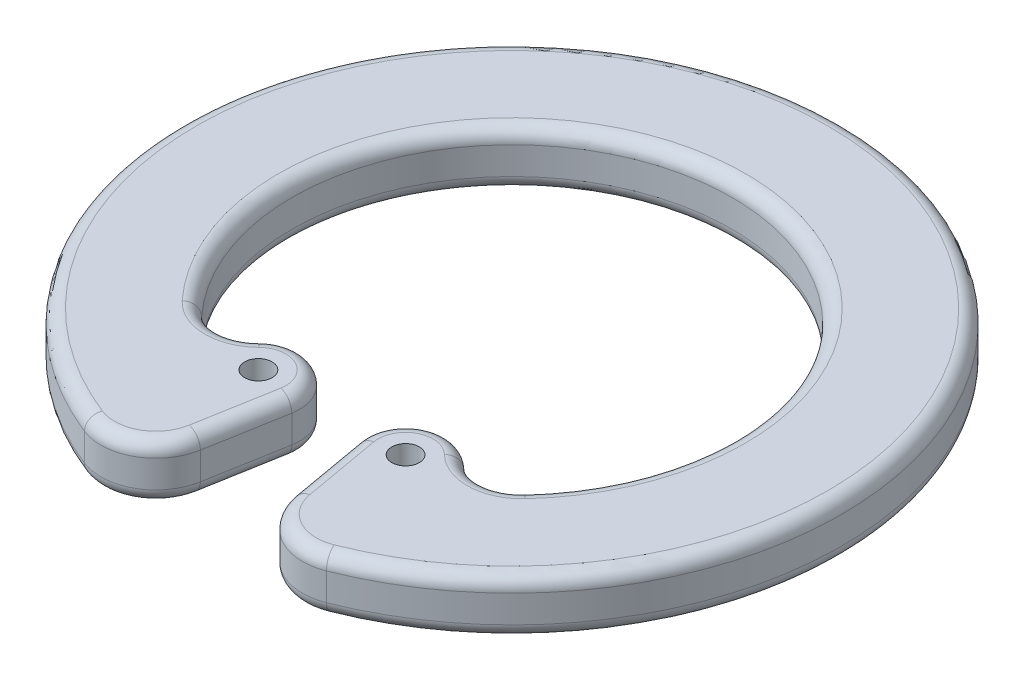
ISO-10303-21;
HEADER;
FILE_DESCRIPTION(('STEP AP214'),'2;1');
FILE_NAME('part.step','',(''),(''),'','','');
FILE_SCHEMA(('AUTOMOTIVE_DESIGN { 1 0 10303 214 1 1 1 1 }'));
ENDSEC;
DATA;
#1=APPLICATION_CONTEXT('core data for automotive mechanical design processes');
#2=APPLICATION_PROTOCOL_DEFINITION('international standard','automotive_design',2000,#1);
#3=PRODUCT_CONTEXT('',#1,'mechanical');
#4=PRODUCT('Part','Part','',(#3));
#5=PRODUCT_RELATED_PRODUCT_CATEGORY('part','',(#4));
#6=PRODUCT_DEFINITION_FORMATION('','',#4);
#7=PRODUCT_DEFINITION_CONTEXT('part definition',#1,'design');
#8=PRODUCT_DEFINITION('design','',#6,#7);
#9=PRODUCT_DEFINITION_SHAPE('','',#8);
#10=(LENGTH_UNIT() NAMED_UNIT(*) SI_UNIT(.MILLI.,.METRE.));
#11=(NAMED_UNIT(*) PLANE_ANGLE_UNIT() SI_UNIT($,.RADIAN.));
#12=(NAMED_UNIT(*) SI_UNIT($,.STERADIAN.) SOLID_ANGLE_UNIT());
#13=UNCERTAINTY_MEASURE_WITH_UNIT(LENGTH_MEASURE(1.E-05),#10,'distance_accuracy_value','');
#14=(GEOMETRIC_REPRESENTATION_CONTEXT(3) GLOBAL_UNCERTAINTY_ASSIGNED_CONTEXT((#13)) GLOBAL_UNIT_ASSIGNED_CONTEXT((#10,
#11,#12)) REPRESENTATION_CONTEXT('',''));
#15=CARTESIAN_POINT('',(0.,0.,0.));
#16=DIRECTION('',(0.,0.,1.));
#17=DIRECTION('',(1.,0.,0.));
#18=AXIS2_PLACEMENT_3D('',#15,#16,#17);
#19=CARTESIAN_POINT('',(3.6710132262169,1.,9.30180960313318));
#20=DIRECTION('',(0.,1.,0.));
#21=DIRECTION('',(0.,0.,1.));
#22=AXIS2_PLACEMENT_3D('',#19,#20,#21);
#23=PLANE('',#22);
#24=DIRECTION('',(0.173648177666924,0.,0.984807753012209));
#25=VECTOR('',#24,1.);
#26=CARTESIAN_POINT('',(2.19380159669859,1.,9.56228186963356));
#27=LINE('',#26,#25);
#28=CARTESIAN_POINT('',(1.6945471049669,1.,6.73086894731305));
#29=VERTEX_POINT('',#28);
#30=CARTESIAN_POINT('',(2.19380159669859,1.,9.56228186963356));
#31=VERTEX_POINT('',#30);
#32=EDGE_CURVE('E60',#29,#31,#27,.T.);
#33=ORIENTED_EDGE('',*,*,#32,.T.);
#34=CARTESIAN_POINT('',(3.6710132262169,1.,9.30180960313318));
#35=DIRECTION('',(0.,1.,0.));
#36=DIRECTION('',(0.,0.,1.));
#37=AXIS2_PLACEMENT_3D('',#34,#35,#36);
#38=CIRCLE('',#37,1.5);
#39=CARTESIAN_POINT('',(4.22166521014944,1.,10.6970810436032));
#40=VERTEX_POINT('',#39);
#41=EDGE_CURVE('E191',#31,#40,#38,.T.);
#42=ORIENTED_EDGE('',*,*,#41,.T.);
#43=CARTESIAN_POINT('',(0.,1.,0.));
#44=DIRECTION('',(0.,1.,0.));
#45=DIRECTION('',(0.,0.,1.));
#46=AXIS2_PLACEMENT_3D('',#43,#44,#45);
#47=CIRCLE('',#46,11.5);
#48=CARTESIAN_POINT('',(-4.22166521014944,1.,10.6970810436032));
#49=VERTEX_POINT('',#48);
#50=EDGE_CURVE('E213',#40,#49,#47,.T.);
#51=ORIENTED_EDGE('',*,*,#50,.T.);
#52=CARTESIAN_POINT('',(-3.6710132262169,1.,9.30180960313317));
#53=DIRECTION('',(0.,1.,0.));
#54=DIRECTION('',(0.,0.,1.));
#55=AXIS2_PLACEMENT_3D('',#52,#53,#54);
#56=CIRCLE('',#55,1.5);
#57=CARTESIAN_POINT('',(-2.19380159669859,1.,9.56228186963356));
#58=VERTEX_POINT('',#57);
#59=EDGE_CURVE('E378',#49,#58,#56,.T.);
#60=ORIENTED_EDGE('',*,*,#59,.T.);
#61=DIRECTION('',(0.173648177666924,0.,-0.984807753012209));
#62=VECTOR('',#61,1.);
#63=CARTESIAN_POINT('',(-1.6945471049669,1.,6.73086894731304));
#64=LINE('',#63,#62);
#65=CARTESIAN_POINT('',(-1.6945471049669,1.,6.73086894731305));
#66=VERTEX_POINT('',#65);
#67=EDGE_CURVE('E380',#58,#66,#64,.T.);
#68=ORIENTED_EDGE('',*,*,#67,.T.);
#69=CARTESIAN_POINT('',(-2.67935485797911,1.,6.55722076964612));
#70=DIRECTION('',(0.,1.,0.));
#71=DIRECTION('',(0.,0.,1.));
#72=AXIS2_PLACEMENT_3D('',#69,#70,#71);
#73=CIRCLE('',#72,1.);
#74=CARTESIAN_POINT('',(-3.37784046289232,1.,5.84159666459584));
#75=VERTEX_POINT('',#74);
#76=EDGE_CURVE('E382',#66,#75,#73,.T.);
#77=ORIENTED_EDGE('',*,*,#76,.T.);
#78=CARTESIAN_POINT('',(-4.77481167271875,1.,4.41034845449526));
#79=DIRECTION('',(0.,1.,0.));
#80=DIRECTION('',(0.,0.,1.));
#81=AXIS2_PLACEMENT_3D('',#78,#79,#80);
#82=CIRCLE('',#81,2.);
#83=CARTESIAN_POINT('',(-6.24398449509375,1.,5.76737874818611));
#84=VERTEX_POINT('',#83);
#85=EDGE_CURVE('E384',#75,#84,#82,.F.);
#86=ORIENTED_EDGE('',*,*,#85,.T.);
#87=CARTESIAN_POINT('',(0.,1.,0.));
#88=DIRECTION('',(0.,1.,0.));
#89=DIRECTION('',(0.,0.,1.));
#90=AXIS2_PLACEMENT_3D('',#87,#88,#89);
#91=CIRCLE('',#90,8.5);
#92=CARTESIAN_POINT('',(6.24398449509375,1.,5.76737874818612));
#93=VERTEX_POINT('',#92);
#94=EDGE_CURVE('E386',#84,#93,#91,.F.);
#95=ORIENTED_EDGE('',*,*,#94,.T.);
#96=CARTESIAN_POINT('',(4.77481167271875,1.,4.41034845449527));
#97=DIRECTION('',(0.,1.,0.));
#98=DIRECTION('',(0.,0.,1.));
#99=AXIS2_PLACEMENT_3D('',#96,#97,#98);
#100=CIRCLE('',#99,2.);
#101=CARTESIAN_POINT('',(3.37784046289232,1.,5.84159666459584));
#102=VERTEX_POINT('',#101);
#103=EDGE_CURVE('E388',#93,#102,#100,.F.);
#104=ORIENTED_EDGE('',*,*,#103,.T.);
#105=CARTESIAN_POINT('',(2.67935485797911,1.,6.55722076964613));
#106=DIRECTION('',(0.,1.,0.));
#107=DIRECTION('',(0.,0.,1.));
#108=AXIS2_PLACEMENT_3D('',#105,#106,#107);
#109=CIRCLE('',#108,1.);
#110=EDGE_CURVE('E65',#102,#29,#109,.T.);
#111=ORIENTED_EDGE('',*,*,#110,.T.);
#112=EDGE_LOOP('',(#33,#42,#51,#60,#68,#77,#86,#95,#104,#111));
#113=FACE_BOUND('',#112,.T.);
#114=CARTESIAN_POINT('',(2.67935485797911,1.,6.55722076964613));
#115=DIRECTION('',(0.,1.,0.));
#116=DIRECTION('',(0.,0.,1.));
#117=AXIS2_PLACEMENT_3D('',#114,#115,#116);
#118=CIRCLE('',#117,0.5);
#119=CARTESIAN_POINT('',(2.67935485797911,1.,7.05722076964613));
#120=VERTEX_POINT('',#119);
#121=EDGE_CURVE('E294',#120,#120,#118,.T.);
#122=ORIENTED_EDGE('',*,*,#121,.F.);
#123=EDGE_LOOP('',(#122));
#124=FACE_BOUND('',#123,.T.);
#125=CARTESIAN_POINT('',(-2.67935485797911,1.,6.55722076964612));
#126=DIRECTION('',(0.,1.,0.));
#127=DIRECTION('',(0.,0.,-1.));
#128=AXIS2_PLACEMENT_3D('',#125,#126,#127);
#129=CIRCLE('',#128,0.5);
#130=CARTESIAN_POINT('',(-2.67935485797911,1.,6.05722076964612));
#131=VERTEX_POINT('',#130);
#132=EDGE_CURVE('E286',#131,#131,#129,.T.);
#133=ORIENTED_EDGE('',*,*,#132,.F.);
#134=EDGE_LOOP('',(#133));
#135=FACE_BOUND('',#134,.T.);
#136=ADVANCED_FACE('F43',(#113,#124,#135),#23,.T.);
#137=CARTESIAN_POINT('',(3.6710132262169,-1.,9.30180960313318));
#138=DIRECTION('',(0.,1.,0.));
#139=DIRECTION('',(0.,0.,1.));
#140=AXIS2_PLACEMENT_3D('',#137,#138,#139);
#141=PLANE('',#140);
#142=CARTESIAN_POINT('',(0.,-1.,0.));
#143=DIRECTION('',(0.,1.,0.));
#144=DIRECTION('',(0.,0.,1.));
#145=AXIS2_PLACEMENT_3D('',#142,#143,#144);
#146=CIRCLE('',#145,11.5);
#147=CARTESIAN_POINT('',(-4.22166521014944,-1.,10.6970810436032));
#148=VERTEX_POINT('',#147);
#149=CARTESIAN_POINT('',(4.22166521014944,-1.,10.6970810436032));
#150=VERTEX_POINT('',#149);
#151=EDGE_CURVE('E324',#148,#150,#146,.F.);
#152=ORIENTED_EDGE('',*,*,#151,.T.);
#153=CARTESIAN_POINT('',(3.6710132262169,-1.,9.30180960313318));
#154=DIRECTION('',(0.,1.,0.));
#155=DIRECTION('',(0.,0.,1.));
#156=AXIS2_PLACEMENT_3D('',#153,#154,#155);
#157=CIRCLE('',#156,1.5);
#158=CARTESIAN_POINT('',(2.19380159669859,-1.,9.56228186963356));
#159=VERTEX_POINT('',#158);
#160=EDGE_CURVE('E342',#150,#159,#157,.F.);
#161=ORIENTED_EDGE('',*,*,#160,.T.);
#162=DIRECTION('',(0.173648177666924,0.,0.984807753012209));
#163=VECTOR('',#162,1.);
#164=CARTESIAN_POINT('',(2.19380159669859,-1.,9.56228186963356));
#165=LINE('',#164,#163);
#166=CARTESIAN_POINT('',(1.6945471049669,-1.,6.73086894731305));
#167=VERTEX_POINT('',#166);
#168=EDGE_CURVE('E340',#159,#167,#165,.F.);
#169=ORIENTED_EDGE('',*,*,#168,.T.);
#170=CARTESIAN_POINT('',(2.67935485797911,-1.,6.55722076964613));
#171=DIRECTION('',(0.,1.,0.));
#172=DIRECTION('',(0.,0.,1.));
#173=AXIS2_PLACEMENT_3D('',#170,#171,#172);
#174=CIRCLE('',#173,1.);
#175=CARTESIAN_POINT('',(3.37784046289232,-1.,5.84159666459584));
#176=VERTEX_POINT('',#175);
#177=EDGE_CURVE('E338',#167,#176,#174,.F.);
#178=ORIENTED_EDGE('',*,*,#177,.T.);
#179=CARTESIAN_POINT('',(4.77481167271875,-1.,4.41034845449527));
#180=DIRECTION('',(0.,1.,0.));
#181=DIRECTION('',(0.,0.,1.));
#182=AXIS2_PLACEMENT_3D('',#179,#180,#181);
#183=CIRCLE('',#182,2.);
#184=CARTESIAN_POINT('',(6.24398449509375,-1.,5.76737874818612));
#185=VERTEX_POINT('',#184);
#186=EDGE_CURVE('E336',#176,#185,#183,.T.);
#187=ORIENTED_EDGE('',*,*,#186,.T.);
#188=CARTESIAN_POINT('',(0.,-1.,0.));
#189=DIRECTION('',(0.,1.,0.));
#190=DIRECTION('',(0.,0.,1.));
#191=AXIS2_PLACEMENT_3D('',#188,#189,#190);
#192=CIRCLE('',#191,8.5);
#193=CARTESIAN_POINT('',(-6.24398449509375,-1.,5.76737874818611));
#194=VERTEX_POINT('',#193);
#195=EDGE_CURVE('E334',#185,#194,#192,.T.);
#196=ORIENTED_EDGE('',*,*,#195,.T.);
#197=CARTESIAN_POINT('',(-4.77481167271875,-1.,4.41034845449526));
#198=DIRECTION('',(0.,1.,0.));
#199=DIRECTION('',(0.,0.,1.));
#200=AXIS2_PLACEMENT_3D('',#197,#198,#199);
#201=CIRCLE('',#200,2.);
#202=CARTESIAN_POINT('',(-3.37784046289232,-1.,5.84159666459584));
#203=VERTEX_POINT('',#202);
#204=EDGE_CURVE('E332',#194,#203,#201,.T.);
#205=ORIENTED_EDGE('',*,*,#204,.T.);
#206=CARTESIAN_POINT('',(-2.67935485797911,-1.,6.55722076964612));
#207=DIRECTION('',(0.,1.,0.));
#208=DIRECTION('',(0.,0.,1.));
#209=AXIS2_PLACEMENT_3D('',#206,#207,#208);
#210=CIRCLE('',#209,1.);
#211=CARTESIAN_POINT('',(-1.6945471049669,-1.,6.73086894731305));
#212=VERTEX_POINT('',#211);
#213=EDGE_CURVE('E330',#203,#212,#210,.F.);
#214=ORIENTED_EDGE('',*,*,#213,.T.);
#215=DIRECTION('',(0.173648177666924,0.,-0.984807753012209));
#216=VECTOR('',#215,1.);
#217=CARTESIAN_POINT('',(-1.9724124099652,-1.,8.30672139985248));
#218=LINE('',#217,#216);
#219=CARTESIAN_POINT('',(-2.19380159669859,-1.,9.56228186963356));
#220=VERTEX_POINT('',#219);
#221=EDGE_CURVE('E328',#212,#220,#218,.F.);
#222=ORIENTED_EDGE('',*,*,#221,.T.);
#223=CARTESIAN_POINT('',(-3.6710132262169,-1.,9.30180960313317));
#224=DIRECTION('',(0.,1.,0.));
#225=DIRECTION('',(0.,0.,1.));
#226=AXIS2_PLACEMENT_3D('',#223,#224,#225);
#227=CIRCLE('',#226,1.5);
#228=EDGE_CURVE('E326',#220,#148,#227,.F.);
#229=ORIENTED_EDGE('',*,*,#228,.T.);
#230=EDGE_LOOP('',(#152,#161,#169,#178,#187,#196,#205,#214,#222,#229));
#231=FACE_BOUND('',#230,.T.);
#232=CARTESIAN_POINT('',(2.67935485797911,-1.,6.55722076964613));
#233=DIRECTION('',(0.,1.,0.));
#234=DIRECTION('',(0.,0.,1.));
#235=AXIS2_PLACEMENT_3D('',#232,#233,#234);
#236=CIRCLE('',#235,0.5);
#237=CARTESIAN_POINT('',(2.67935485797911,-1.,7.05722076964613));
#238=VERTEX_POINT('',#237);
#239=EDGE_CURVE('E291',#238,#238,#236,.T.);
#240=ORIENTED_EDGE('',*,*,#239,.T.);
#241=EDGE_LOOP('',(#240));
#242=FACE_BOUND('',#241,.T.);
#243=CARTESIAN_POINT('',(-2.67935485797911,-1.,6.55722076964612));
#244=DIRECTION('',(0.,1.,0.));
#245=DIRECTION('',(0.,0.,-1.));
#246=AXIS2_PLACEMENT_3D('',#243,#244,#245);
#247=CIRCLE('',#246,0.5);
#248=CARTESIAN_POINT('',(-2.67935485797911,-1.,6.05722076964612));
#249=VERTEX_POINT('',#248);
#250=EDGE_CURVE('E280',#249,#249,#247,.T.);
#251=ORIENTED_EDGE('',*,*,#250,.T.);
#252=EDGE_LOOP('',(#251));
#253=FACE_BOUND('',#252,.T.);
#254=ADVANCED_FACE('F425',(#231,#242,#253),#141,.F.);
#255=CARTESIAN_POINT('',(3.6710132262169,1.,9.30180960313318));
#256=DIRECTION('',(0.,-1.,0.));
#257=DIRECTION('',(0.,0.,-1.));
#258=AXIS2_PLACEMENT_3D('',#255,#256,#257);
#259=CYLINDRICAL_SURFACE('',#258,2.);
#260=DIRECTION('',(0.,-1.,0.));
#261=VECTOR('',#260,1.);
#262=CARTESIAN_POINT('',(1.70139772019248,1.,9.64910595846703));
#263=LINE('',#262,#261);
#264=CARTESIAN_POINT('',(1.70139772019248,0.5,9.64910595846703));
#265=VERTEX_POINT('',#264);
#266=CARTESIAN_POINT('',(1.70139772019248,-0.5,9.64910595846703));
#267=VERTEX_POINT('',#266);
#268=EDGE_CURVE('E297',#265,#267,#263,.T.);
#269=ORIENTED_EDGE('',*,*,#268,.T.);
#270=CARTESIAN_POINT('',(3.6710132262169,-0.5,9.30180960313318));
#271=DIRECTION('',(0.,1.,0.));
#272=DIRECTION('',(0.,0.,1.));
#273=AXIS2_PLACEMENT_3D('',#270,#271,#272);
#274=CIRCLE('',#273,2.);
#275=CARTESIAN_POINT('',(4.40521587146028,-0.5,11.1621715237598));
#276=VERTEX_POINT('',#275);
#277=EDGE_CURVE('E202',#267,#276,#274,.T.);
#278=ORIENTED_EDGE('',*,*,#277,.T.);
#279=DIRECTION('',(0.,-1.,0.));
#280=VECTOR('',#279,1.);
#281=CARTESIAN_POINT('',(4.40521587146028,1.,11.1621715237598));
#282=LINE('',#281,#280);
#283=CARTESIAN_POINT('',(4.40521587146028,0.5,11.1621715237598));
#284=VERTEX_POINT('',#283);
#285=EDGE_CURVE('E184',#284,#276,#282,.T.);
#286=ORIENTED_EDGE('',*,*,#285,.F.);
#287=CARTESIAN_POINT('',(3.6710132262169,0.5,9.30180960313318));
#288=DIRECTION('',(0.,1.,0.));
#289=DIRECTION('',(0.,0.,1.));
#290=AXIS2_PLACEMENT_3D('',#287,#288,#289);
#291=CIRCLE('',#290,2.);
#292=EDGE_CURVE('E199',#284,#265,#291,.F.);
#293=ORIENTED_EDGE('',*,*,#292,.T.);
#294=EDGE_LOOP('',(#269,#278,#286,#293));
#295=FACE_BOUND('',#294,.T.);
#296=ADVANCED_FACE('F198',(#295),#259,.T.);
#297=CARTESIAN_POINT('',(0.,1.,0.));
#298=DIRECTION('',(0.,-1.,0.));
#299=DIRECTION('',(0.,0.,-1.));
#300=AXIS2_PLACEMENT_3D('',#297,#298,#299);
#301=CYLINDRICAL_SURFACE('',#300,12.);
#302=ORIENTED_EDGE('',*,*,#285,.T.);
#303=CARTESIAN_POINT('',(0.,-0.5,0.));
#304=DIRECTION('',(0.,1.,0.));
#305=DIRECTION('',(0.,0.,1.));
#306=AXIS2_PLACEMENT_3D('',#303,#304,#305);
#307=CIRCLE('',#306,12.);
#308=CARTESIAN_POINT('',(-4.40521587146028,-0.5,11.1621715237598));
#309=VERTEX_POINT('',#308);
#310=EDGE_CURVE('E11',#276,#309,#307,.T.);
#311=ORIENTED_EDGE('',*,*,#310,.T.);
#312=DIRECTION('',(0.,-1.,0.));
#313=VECTOR('',#312,1.);
#314=CARTESIAN_POINT('',(-4.40521587146028,1.,11.1621715237598));
#315=LINE('',#314,#313);
#316=CARTESIAN_POINT('',(-4.40521587146028,0.5,11.1621715237598));
#317=VERTEX_POINT('',#316);
#318=EDGE_CURVE('E186',#317,#309,#315,.T.);
#319=ORIENTED_EDGE('',*,*,#318,.F.);
#320=CARTESIAN_POINT('',(0.,0.5,0.));
#321=DIRECTION('',(0.,1.,0.));
#322=DIRECTION('',(0.,0.,1.));
#323=AXIS2_PLACEMENT_3D('',#320,#321,#322);
#324=CIRCLE('',#323,12.);
#325=EDGE_CURVE('E52',#317,#284,#324,.F.);
#326=ORIENTED_EDGE('',*,*,#325,.T.);
#327=EDGE_LOOP('',(#302,#311,#319,#326));
#328=FACE_BOUND('',#327,.T.);
#329=ADVANCED_FACE('F183',(#328),#301,.T.);
#330=CARTESIAN_POINT('',(-3.6710132262169,1.,9.30180960313317));
#331=DIRECTION('',(0.,-1.,0.));
#332=DIRECTION('',(0.,0.,-1.));
#333=AXIS2_PLACEMENT_3D('',#330,#331,#332);
#334=CYLINDRICAL_SURFACE('',#333,2.);
#335=ORIENTED_EDGE('',*,*,#318,.T.);
#336=CARTESIAN_POINT('',(-3.6710132262169,-0.5,9.30180960313317));
#337=DIRECTION('',(0.,1.,0.));
#338=DIRECTION('',(0.,0.,1.));
#339=AXIS2_PLACEMENT_3D('',#336,#337,#338);
#340=CIRCLE('',#339,2.);
#341=CARTESIAN_POINT('',(-1.70139772019248,-0.5,9.64910595846702));
#342=VERTEX_POINT('',#341);
#343=EDGE_CURVE('E375',#309,#342,#340,.T.);
#344=ORIENTED_EDGE('',*,*,#343,.T.);
#345=DIRECTION('',(0.,-1.,0.));
#346=VECTOR('',#345,1.);
#347=CARTESIAN_POINT('',(-1.70139772019248,1.,9.64910595846702));
#348=LINE('',#347,#346);
#349=CARTESIAN_POINT('',(-1.70139772019248,0.5,9.64910595846702));
#350=VERTEX_POINT('',#349);
#351=EDGE_CURVE('E319',#350,#342,#348,.T.);
#352=ORIENTED_EDGE('',*,*,#351,.F.);
#353=CARTESIAN_POINT('',(-3.6710132262169,0.5,9.30180960313317));
#354=DIRECTION('',(0.,1.,0.));
#355=DIRECTION('',(0.,0.,1.));
#356=AXIS2_PLACEMENT_3D('',#353,#354,#355);
#357=CIRCLE('',#356,2.);
#358=EDGE_CURVE('E373',#350,#317,#357,.F.);
#359=ORIENTED_EDGE('',*,*,#358,.T.);
#360=EDGE_LOOP('',(#335,#344,#352,#359));
#361=FACE_BOUND('',#360,.T.);
#362=ADVANCED_FACE('F509',(#361),#334,.T.);
#363=CARTESIAN_POINT('',(-1.70139772019248,1.,9.64910595846702));
#364=DIRECTION('',(-0.984807753012209,0.,-0.173648177666924));
#365=DIRECTION('',(-0.173648177666924,0.,0.984807753012209));
#366=AXIS2_PLACEMENT_3D('',#363,#364,#365);
#367=PLANE('',#366);
#368=ORIENTED_EDGE('',*,*,#351,.T.);
#369=DIRECTION('',(0.173648177666924,0.,-0.984807753012209));
#370=VECTOR('',#369,1.);
#371=CARTESIAN_POINT('',(-1.70139772019248,-0.5,9.64910595846702));
#372=LINE('',#371,#370);
#373=CARTESIAN_POINT('',(-1.20214322846079,-0.5,6.81769303614651));
#374=VERTEX_POINT('',#373);
#375=EDGE_CURVE('E371',#342,#374,#372,.T.);
#376=ORIENTED_EDGE('',*,*,#375,.T.);
#377=DIRECTION('',(0.,-1.,0.));
#378=VECTOR('',#377,1.);
#379=CARTESIAN_POINT('',(-1.20214322846079,1.,6.81769303614651));
#380=LINE('',#379,#378);
#381=CARTESIAN_POINT('',(-1.20214322846079,0.5,6.81769303614651));
#382=VERTEX_POINT('',#381);
#383=EDGE_CURVE('E316',#382,#374,#380,.T.);
#384=ORIENTED_EDGE('',*,*,#383,.F.);
#385=DIRECTION('',(0.173648177666924,0.,-0.984807753012209));
#386=VECTOR('',#385,1.);
#387=CARTESIAN_POINT('',(-1.70139772019248,0.5,9.64910595846702));
#388=LINE('',#387,#386);
#389=EDGE_CURVE('E369',#382,#350,#388,.F.);
#390=ORIENTED_EDGE('',*,*,#389,.T.);
#391=EDGE_LOOP('',(#368,#376,#384,#390));
#392=FACE_BOUND('',#391,.T.);
#393=ADVANCED_FACE('F410',(#392),#367,.F.);
#394=CARTESIAN_POINT('',(-2.67935485797911,1.,6.55722076964612));
#395=DIRECTION('',(0.,-1.,0.));
#396=DIRECTION('',(0.,0.,-1.));
#397=AXIS2_PLACEMENT_3D('',#394,#395,#396);
#398=CYLINDRICAL_SURFACE('',#397,1.5);
#399=ORIENTED_EDGE('',*,*,#383,.T.);
#400=CARTESIAN_POINT('',(-2.67935485797911,-0.5,6.55722076964612));
#401=DIRECTION('',(0.,1.,0.));
#402=DIRECTION('',(0.,0.,1.));
#403=AXIS2_PLACEMENT_3D('',#400,#401,#402);
#404=CIRCLE('',#403,1.5);
#405=CARTESIAN_POINT('',(-3.72708326534893,-0.5,5.48378461207069));
#406=VERTEX_POINT('',#405);
#407=EDGE_CURVE('E367',#374,#406,#404,.T.);
#408=ORIENTED_EDGE('',*,*,#407,.T.);
#409=DIRECTION('',(0.,-1.,0.));
#410=VECTOR('',#409,1.);
#411=CARTESIAN_POINT('',(-3.72708326534893,1.,5.48378461207069));
#412=LINE('',#411,#410);
#413=CARTESIAN_POINT('',(-3.72708326534893,0.5,5.48378461207069));
#414=VERTEX_POINT('',#413);
#415=EDGE_CURVE('E313',#414,#406,#412,.T.);
#416=ORIENTED_EDGE('',*,*,#415,.F.);
#417=CARTESIAN_POINT('',(-2.67935485797911,0.5,6.55722076964612));
#418=DIRECTION('',(0.,1.,0.));
#419=DIRECTION('',(0.,0.,1.));
#420=AXIS2_PLACEMENT_3D('',#417,#418,#419);
#421=CIRCLE('',#420,1.5);
#422=EDGE_CURVE('E365',#414,#382,#421,.F.);
#423=ORIENTED_EDGE('',*,*,#422,.T.);
#424=EDGE_LOOP('',(#399,#408,#416,#423));
#425=FACE_BOUND('',#424,.T.);
#426=ADVANCED_FACE('F408',(#425),#398,.T.);
#427=CARTESIAN_POINT('',(-4.77481167271875,1.,4.41034845449526));
#428=DIRECTION('',(0.,-1.,0.));
#429=DIRECTION('',(0.,0.,-1.));
#430=AXIS2_PLACEMENT_3D('',#427,#428,#429);
#431=CYLINDRICAL_SURFACE('',#430,1.5);
#432=ORIENTED_EDGE('',*,*,#415,.T.);
#433=CARTESIAN_POINT('',(-4.77481167271875,-0.5,4.41034845449526));
#434=DIRECTION('',(0.,1.,0.));
#435=DIRECTION('',(0.,0.,1.));
#436=AXIS2_PLACEMENT_3D('',#433,#434,#435);
#437=CIRCLE('',#436,1.5);
#438=CARTESIAN_POINT('',(-5.8766912895,-0.5,5.4281211747634));
#439=VERTEX_POINT('',#438);
#440=EDGE_CURVE('E363',#406,#439,#437,.F.);
#441=ORIENTED_EDGE('',*,*,#440,.T.);
#442=DIRECTION('',(0.,-1.,0.));
#443=VECTOR('',#442,1.);
#444=CARTESIAN_POINT('',(-5.8766912895,1.,5.4281211747634));
#445=LINE('',#444,#443);
#446=CARTESIAN_POINT('',(-5.8766912895,0.5,5.4281211747634));
#447=VERTEX_POINT('',#446);
#448=EDGE_CURVE('E310',#447,#439,#445,.T.);
#449=ORIENTED_EDGE('',*,*,#448,.F.);
#450=CARTESIAN_POINT('',(-4.77481167271875,0.5,4.41034845449526));
#451=DIRECTION('',(0.,1.,0.));
#452=DIRECTION('',(0.,0.,1.));
#453=AXIS2_PLACEMENT_3D('',#450,#451,#452);
#454=CIRCLE('',#453,1.5);
#455=EDGE_CURVE('E361',#447,#414,#454,.T.);
#456=ORIENTED_EDGE('',*,*,#455,.T.);
#457=EDGE_LOOP('',(#432,#441,#449,#456));
#458=FACE_BOUND('',#457,.T.);
#459=ADVANCED_FACE('F431',(#458),#431,.F.);
#460=CARTESIAN_POINT('',(0.,1.,0.));
#461=DIRECTION('',(0.,-1.,0.));
#462=DIRECTION('',(0.,0.,-1.));
#463=AXIS2_PLACEMENT_3D('',#460,#461,#462);
#464=CYLINDRICAL_SURFACE('',#463,8.);
#465=ORIENTED_EDGE('',*,*,#448,.T.);
#466=CARTESIAN_POINT('',(0.,-0.5,0.));
#467=DIRECTION('',(0.,1.,0.));
#468=DIRECTION('',(0.,0.,1.));
#469=AXIS2_PLACEMENT_3D('',#466,#467,#468);
#470=CIRCLE('',#469,8.);
#471=CARTESIAN_POINT('',(5.8766912895,-0.5,5.42812117476341));
#472=VERTEX_POINT('',#471);
#473=EDGE_CURVE('E359',#439,#472,#470,.F.);
#474=ORIENTED_EDGE('',*,*,#473,.T.);
#475=DIRECTION('',(0.,-1.,0.));
#476=VECTOR('',#475,1.);
#477=CARTESIAN_POINT('',(5.8766912895,1.,5.42812117476341));
#478=LINE('',#477,#476);
#479=CARTESIAN_POINT('',(5.8766912895,0.5,5.42812117476341));
#480=VERTEX_POINT('',#479);
#481=EDGE_CURVE('E307',#480,#472,#478,.T.);
#482=ORIENTED_EDGE('',*,*,#481,.F.);
#483=CARTESIAN_POINT('',(0.,0.5,0.));
#484=DIRECTION('',(0.,1.,0.));
#485=DIRECTION('',(0.,0.,1.));
#486=AXIS2_PLACEMENT_3D('',#483,#484,#485);
#487=CIRCLE('',#486,8.);
#488=EDGE_CURVE('E357',#480,#447,#487,.T.);
#489=ORIENTED_EDGE('',*,*,#488,.T.);
#490=EDGE_LOOP('',(#465,#474,#482,#489));
#491=FACE_BOUND('',#490,.T.);
#492=ADVANCED_FACE('F441',(#491),#464,.F.);
#493=CARTESIAN_POINT('',(4.77481167271875,1.,4.41034845449527));
#494=DIRECTION('',(0.,-1.,0.));
#495=DIRECTION('',(0.,0.,-1.));
#496=AXIS2_PLACEMENT_3D('',#493,#494,#495);
#497=CYLINDRICAL_SURFACE('',#496,1.5);
#498=ORIENTED_EDGE('',*,*,#481,.T.);
#499=CARTESIAN_POINT('',(4.77481167271875,-0.5,4.41034845449527));
#500=DIRECTION('',(0.,1.,0.));
#501=DIRECTION('',(0.,0.,1.));
#502=AXIS2_PLACEMENT_3D('',#499,#500,#501);
#503=CIRCLE('',#502,1.5);
#504=CARTESIAN_POINT('',(3.72708326534893,-0.5,5.4837846120707));
#505=VERTEX_POINT('',#504);
#506=EDGE_CURVE('E355',#472,#505,#503,.F.);
#507=ORIENTED_EDGE('',*,*,#506,.T.);
#508=DIRECTION('',(0.,-1.,0.));
#509=VECTOR('',#508,1.);
#510=CARTESIAN_POINT('',(3.72708326534893,1.,5.4837846120707));
#511=LINE('',#510,#509);
#512=CARTESIAN_POINT('',(3.72708326534893,0.5,5.4837846120707));
#513=VERTEX_POINT('',#512);
#514=EDGE_CURVE('E304',#513,#505,#511,.T.);
#515=ORIENTED_EDGE('',*,*,#514,.F.);
#516=CARTESIAN_POINT('',(4.77481167271875,0.5,4.41034845449527));
#517=DIRECTION('',(0.,1.,0.));
#518=DIRECTION('',(0.,0.,1.));
#519=AXIS2_PLACEMENT_3D('',#516,#517,#518);
#520=CIRCLE('',#519,1.5);
#521=EDGE_CURVE('E353',#513,#480,#520,.T.);
#522=ORIENTED_EDGE('',*,*,#521,.T.);
#523=EDGE_LOOP('',(#498,#507,#515,#522));
#524=FACE_BOUND('',#523,.T.);
#525=ADVANCED_FACE('F443',(#524),#497,.F.);
#526=CARTESIAN_POINT('',(2.67935485797911,1.,6.55722076964613));
#527=DIRECTION('',(0.,-1.,0.));
#528=DIRECTION('',(0.,0.,-1.));
#529=AXIS2_PLACEMENT_3D('',#526,#527,#528);
#530=CYLINDRICAL_SURFACE('',#529,1.5);
#531=ORIENTED_EDGE('',*,*,#514,.T.);
#532=CARTESIAN_POINT('',(2.67935485797911,-0.5,6.55722076964613));
#533=DIRECTION('',(0.,1.,0.));
#534=DIRECTION('',(0.,0.,1.));
#535=AXIS2_PLACEMENT_3D('',#532,#533,#534);
#536=CIRCLE('',#535,1.5);
#537=CARTESIAN_POINT('',(1.20214322846079,-0.5,6.81769303614651));
#538=VERTEX_POINT('',#537);
#539=EDGE_CURVE('E351',#505,#538,#536,.T.);
#540=ORIENTED_EDGE('',*,*,#539,.T.);
#541=DIRECTION('',(0.,-1.,0.));
#542=VECTOR('',#541,1.);
#543=CARTESIAN_POINT('',(1.20214322846079,1.,6.81769303614651));
#544=LINE('',#543,#542);
#545=CARTESIAN_POINT('',(1.20214322846079,0.5,6.81769303614651));
#546=VERTEX_POINT('',#545);
#547=EDGE_CURVE('E301',#546,#538,#544,.T.);
#548=ORIENTED_EDGE('',*,*,#547,.F.);
#549=CARTESIAN_POINT('',(2.67935485797911,0.5,6.55722076964613));
#550=DIRECTION('',(0.,1.,0.));
#551=DIRECTION('',(0.,0.,1.));
#552=AXIS2_PLACEMENT_3D('',#549,#550,#551);
#553=CIRCLE('',#552,1.5);
#554=EDGE_CURVE('E349',#546,#513,#553,.F.);
#555=ORIENTED_EDGE('',*,*,#554,.T.);
#556=EDGE_LOOP('',(#531,#540,#548,#555));
#557=FACE_BOUND('',#556,.T.);
#558=ADVANCED_FACE('F461',(#557),#530,.T.);
#559=CARTESIAN_POINT('',(1.70139772019248,1.,9.64910595846703));
#560=DIRECTION('',(0.984807753012209,0.,-0.173648177666924));
#561=DIRECTION('',(-0.173648177666924,0.,-0.984807753012209));
#562=AXIS2_PLACEMENT_3D('',#559,#560,#561);
#563=PLANE('',#562);
#564=ORIENTED_EDGE('',*,*,#547,.T.);
#565=DIRECTION('',(0.173648177666924,0.,0.984807753012209));
#566=VECTOR('',#565,1.);
#567=CARTESIAN_POINT('',(1.70139772019248,-0.5,9.64910595846703));
#568=LINE('',#567,#566);
#569=EDGE_CURVE('E347',#538,#267,#568,.T.);
#570=ORIENTED_EDGE('',*,*,#569,.T.);
#571=ORIENTED_EDGE('',*,*,#268,.F.);
#572=DIRECTION('',(0.173648177666924,0.,0.984807753012209));
#573=VECTOR('',#572,1.);
#574=CARTESIAN_POINT('',(1.20214322846079,0.5,6.81769303614651));
#575=LINE('',#574,#573);
#576=EDGE_CURVE('E345',#265,#546,#575,.F.);
#577=ORIENTED_EDGE('',*,*,#576,.T.);
#578=EDGE_LOOP('',(#564,#570,#571,#577));
#579=FACE_BOUND('',#578,.T.);
#580=ADVANCED_FACE('F458',(#579),#563,.F.);
#581=CARTESIAN_POINT('',(2.67935485797911,1.,6.55722076964613));
#582=DIRECTION('',(0.,-1.,0.));
#583=DIRECTION('',(0.,0.,-1.));
#584=AXIS2_PLACEMENT_3D('',#581,#582,#583);
#585=CYLINDRICAL_SURFACE('',#584,0.5);
#586=ORIENTED_EDGE('',*,*,#121,.T.);
#587=EDGE_LOOP('',(#586));
#588=FACE_BOUND('',#587,.T.);
#589=ORIENTED_EDGE('',*,*,#239,.F.);
#590=EDGE_LOOP('',(#589));
#591=FACE_BOUND('',#590,.T.);
#592=ADVANCED_FACE('F492',(#588,#591),#585,.F.);
#593=CARTESIAN_POINT('',(-2.67935485797911,1.,6.55722076964612));
#594=DIRECTION('',(0.,-1.,0.));
#595=DIRECTION('',(0.,0.,-1.));
#596=AXIS2_PLACEMENT_3D('',#593,#594,#595);
#597=CYLINDRICAL_SURFACE('',#596,0.5);
#598=ORIENTED_EDGE('',*,*,#132,.T.);
#599=EDGE_LOOP('',(#598));
#600=FACE_BOUND('',#599,.T.);
#601=ORIENTED_EDGE('',*,*,#250,.F.);
#602=EDGE_LOOP('',(#601));
#603=FACE_BOUND('',#602,.T.);
#604=ADVANCED_FACE('F562',(#600,#603),#597,.F.);
#605=CARTESIAN_POINT('',(-4.77481167271875,-0.5,4.41034845449526));
#606=DIRECTION('',(0.,1.,0.));
#607=DIRECTION('',(0.,0.,1.));
#608=AXIS2_PLACEMENT_3D('',#605,#606,#607);
#609=TOROIDAL_SURFACE('',#608,2.,0.5);
#610=CARTESIAN_POINT('',(-3.37784046289232,-0.5,5.84159666459584));
#611=DIRECTION('',(0.715624105050286,0.,-0.698485604913213));
#612=DIRECTION('',(-0.698485604913213,0.,-0.715624105050286));
#613=AXIS2_PLACEMENT_3D('',#610,#611,#612);
#614=CIRCLE('',#613,0.5);
#615=EDGE_CURVE('E273',#203,#406,#614,.T.);
#616=ORIENTED_EDGE('',*,*,#615,.F.);
#617=ORIENTED_EDGE('',*,*,#204,.F.);
#618=CARTESIAN_POINT('',(-6.24398449509376,-0.5,5.76737874818611));
#619=DIRECTION('',(-0.678515146845422,0.,-0.734586411187503));
#620=DIRECTION('',(-0.734586411187503,0.,0.678515146845422));
#621=AXIS2_PLACEMENT_3D('',#618,#619,#620);
#622=CIRCLE('',#621,0.5);
#623=EDGE_CURVE('E218',#439,#194,#622,.T.);
#624=ORIENTED_EDGE('',*,*,#623,.F.);
#625=ORIENTED_EDGE('',*,*,#440,.F.);
#626=EDGE_LOOP('',(#616,#617,#624,#625));
#627=FACE_BOUND('',#626,.T.);
#628=ADVANCED_FACE('F435',(#627),#609,.T.);
#629=CARTESIAN_POINT('',(0.,-0.5,0.));
#630=DIRECTION('',(0.,1.,0.));
#631=DIRECTION('',(0.,0.,1.));
#632=AXIS2_PLACEMENT_3D('',#629,#630,#631);
#633=TOROIDAL_SURFACE('',#632,8.5,0.5);
#634=ORIENTED_EDGE('',*,*,#623,.T.);
#635=ORIENTED_EDGE('',*,*,#195,.F.);
#636=CARTESIAN_POINT('',(6.24398449509375,-0.5,5.76737874818612));
#637=DIRECTION('',(-0.678515146845426,0.,0.7345864111875));
#638=DIRECTION('',(0.7345864111875,0.,0.678515146845426));
#639=AXIS2_PLACEMENT_3D('',#636,#637,#638);
#640=CIRCLE('',#639,0.5);
#641=EDGE_CURVE('E271',#472,#185,#640,.T.);
#642=ORIENTED_EDGE('',*,*,#641,.F.);
#643=ORIENTED_EDGE('',*,*,#473,.F.);
#644=EDGE_LOOP('',(#634,#635,#642,#643));
#645=FACE_BOUND('',#644,.T.);
#646=ADVANCED_FACE('F437',(#645),#633,.T.);
#647=CARTESIAN_POINT('',(-2.67935485797911,-0.5,6.55722076964612));
#648=DIRECTION('',(0.,1.,0.));
#649=DIRECTION('',(0.,0.,1.));
#650=AXIS2_PLACEMENT_3D('',#647,#648,#649);
#651=TOROIDAL_SURFACE('',#650,1.,0.5);
#652=ORIENTED_EDGE('',*,*,#615,.T.);
#653=ORIENTED_EDGE('',*,*,#407,.F.);
#654=CARTESIAN_POINT('',(-1.6945471049669,-0.5,6.73086894731305));
#655=DIRECTION('',(-0.173648177666923,0.,0.984807753012209));
#656=DIRECTION('',(0.984807753012209,0.,0.173648177666923));
#657=AXIS2_PLACEMENT_3D('',#654,#655,#656);
#658=CIRCLE('',#657,0.5);
#659=EDGE_CURVE('E268',#212,#374,#658,.T.);
#660=ORIENTED_EDGE('',*,*,#659,.F.);
#661=ORIENTED_EDGE('',*,*,#213,.F.);
#662=EDGE_LOOP('',(#652,#653,#660,#661));
#663=FACE_BOUND('',#662,.T.);
#664=ADVANCED_FACE('F428',(#663),#651,.T.);
#665=CARTESIAN_POINT('',(4.77481167271875,-0.5,4.41034845449527));
#666=DIRECTION('',(0.,1.,0.));
#667=DIRECTION('',(0.,0.,1.));
#668=AXIS2_PLACEMENT_3D('',#665,#666,#667);
#669=TOROIDAL_SURFACE('',#668,2.,0.5);
#670=ORIENTED_EDGE('',*,*,#641,.T.);
#671=ORIENTED_EDGE('',*,*,#186,.F.);
#672=CARTESIAN_POINT('',(3.37784046289232,-0.5,5.84159666459584));
#673=DIRECTION('',(-0.715624105050286,0.,-0.698485604913213));
#674=DIRECTION('',(-0.698485604913213,0.,0.715624105050286));
#675=AXIS2_PLACEMENT_3D('',#672,#673,#674);
#676=CIRCLE('',#675,0.5);
#677=EDGE_CURVE('E265',#505,#176,#676,.T.);
#678=ORIENTED_EDGE('',*,*,#677,.F.);
#679=ORIENTED_EDGE('',*,*,#506,.F.);
#680=EDGE_LOOP('',(#670,#671,#678,#679));
#681=FACE_BOUND('',#680,.T.);
#682=ADVANCED_FACE('F586',(#681),#669,.T.);
#683=CARTESIAN_POINT('',(-2.19380159669859,-0.5,9.56228186963356));
#684=DIRECTION('',(0.173648177666924,0.,-0.984807753012209));
#685=DIRECTION('',(-0.984807753012209,0.,-0.173648177666924));
#686=AXIS2_PLACEMENT_3D('',#683,#684,#685);
#687=CYLINDRICAL_SURFACE('',#686,0.5);
#688=ORIENTED_EDGE('',*,*,#659,.T.);
#689=ORIENTED_EDGE('',*,*,#375,.F.);
#690=CARTESIAN_POINT('',(-2.19380159669859,-0.5,9.56228186963356));
#691=DIRECTION('',(-0.173648177666925,0.,0.984807753012209));
#692=DIRECTION('',(0.984807753012209,0.,0.173648177666925));
#693=AXIS2_PLACEMENT_3D('',#690,#691,#692);
#694=CIRCLE('',#693,0.5);
#695=EDGE_CURVE('E262',#220,#342,#694,.T.);
#696=ORIENTED_EDGE('',*,*,#695,.F.);
#697=ORIENTED_EDGE('',*,*,#221,.F.);
#698=EDGE_LOOP('',(#688,#689,#696,#697));
#699=FACE_BOUND('',#698,.T.);
#700=ADVANCED_FACE('F415',(#699),#687,.T.);
#701=CARTESIAN_POINT('',(2.67935485797911,-0.5,6.55722076964613));
#702=DIRECTION('',(0.,1.,0.));
#703=DIRECTION('',(0.,0.,1.));
#704=AXIS2_PLACEMENT_3D('',#701,#702,#703);
#705=TOROIDAL_SURFACE('',#704,1.,0.5);
#706=ORIENTED_EDGE('',*,*,#677,.T.);
#707=ORIENTED_EDGE('',*,*,#177,.F.);
#708=CARTESIAN_POINT('',(1.6945471049669,-0.5,6.73086894731305));
#709=DIRECTION('',(0.173648177666923,0.,0.984807753012209));
#710=DIRECTION('',(0.984807753012209,0.,-0.173648177666923));
#711=AXIS2_PLACEMENT_3D('',#708,#709,#710);
#712=CIRCLE('',#711,0.5);
#713=EDGE_CURVE('E259',#538,#167,#712,.T.);
#714=ORIENTED_EDGE('',*,*,#713,.F.);
#715=ORIENTED_EDGE('',*,*,#539,.F.);
#716=EDGE_LOOP('',(#706,#707,#714,#715));
#717=FACE_BOUND('',#716,.T.);
#718=ADVANCED_FACE('F465',(#717),#705,.T.);
#719=CARTESIAN_POINT('',(-3.6710132262169,-0.5,9.30180960313317));
#720=DIRECTION('',(0.,1.,0.));
#721=DIRECTION('',(0.,0.,1.));
#722=AXIS2_PLACEMENT_3D('',#719,#720,#721);
#723=TOROIDAL_SURFACE('',#722,1.5,0.5);
#724=ORIENTED_EDGE('',*,*,#695,.T.);
#725=ORIENTED_EDGE('',*,*,#343,.F.);
#726=CARTESIAN_POINT('',(-4.22166521014944,-0.5,10.6970810436031));
#727=DIRECTION('',(-0.930180960313318,0.,-0.36710132262169));
#728=DIRECTION('',(-0.36710132262169,0.,0.930180960313318));
#729=AXIS2_PLACEMENT_3D('',#726,#727,#728);
#730=CIRCLE('',#729,0.5);
#731=EDGE_CURVE('E254',#148,#309,#730,.T.);
#732=ORIENTED_EDGE('',*,*,#731,.F.);
#733=ORIENTED_EDGE('',*,*,#228,.F.);
#734=EDGE_LOOP('',(#724,#725,#732,#733));
#735=FACE_BOUND('',#734,.T.);
#736=ADVANCED_FACE('F421',(#735),#723,.T.);
#737=CARTESIAN_POINT('',(2.19380159669859,-0.5,9.56228186963356));
#738=DIRECTION('',(0.173648177666924,0.,0.984807753012209));
#739=DIRECTION('',(0.984807753012209,0.,-0.173648177666924));
#740=AXIS2_PLACEMENT_3D('',#737,#738,#739);
#741=CYLINDRICAL_SURFACE('',#740,0.5);
#742=ORIENTED_EDGE('',*,*,#713,.T.);
#743=ORIENTED_EDGE('',*,*,#168,.F.);
#744=CARTESIAN_POINT('',(2.19380159669859,-0.5,9.56228186963356));
#745=DIRECTION('',(0.173648177666925,0.,0.984807753012209));
#746=DIRECTION('',(0.984807753012209,0.,-0.173648177666925));
#747=AXIS2_PLACEMENT_3D('',#744,#745,#746);
#748=CIRCLE('',#747,0.5);
#749=EDGE_CURVE('E248',#267,#159,#748,.T.);
#750=ORIENTED_EDGE('',*,*,#749,.F.);
#751=ORIENTED_EDGE('',*,*,#569,.F.);
#752=EDGE_LOOP('',(#742,#743,#750,#751));
#753=FACE_BOUND('',#752,.T.);
#754=ADVANCED_FACE('F471',(#753),#741,.T.);
#755=CARTESIAN_POINT('',(0.,-0.5,0.));
#756=DIRECTION('',(0.,1.,0.));
#757=DIRECTION('',(0.,0.,1.));
#758=AXIS2_PLACEMENT_3D('',#755,#756,#757);
#759=TOROIDAL_SURFACE('',#758,11.5,0.5);
#760=ORIENTED_EDGE('',*,*,#731,.T.);
#761=ORIENTED_EDGE('',*,*,#310,.F.);
#762=CARTESIAN_POINT('',(4.22166521014944,-0.5,10.6970810436032));
#763=DIRECTION('',(-0.930180960313318,0.,0.367101322621688));
#764=DIRECTION('',(0.367101322621689,0.,0.930180960313318));
#765=AXIS2_PLACEMENT_3D('',#762,#763,#764);
#766=CIRCLE('',#765,0.5);
#767=EDGE_CURVE('E243',#150,#276,#766,.T.);
#768=ORIENTED_EDGE('',*,*,#767,.F.);
#769=ORIENTED_EDGE('',*,*,#151,.F.);
#770=EDGE_LOOP('',(#760,#761,#768,#769));
#771=FACE_BOUND('',#770,.T.);
#772=ADVANCED_FACE('F474',(#771),#759,.T.);
#773=CARTESIAN_POINT('',(3.6710132262169,-0.5,9.30180960313318));
#774=DIRECTION('',(0.,1.,0.));
#775=DIRECTION('',(0.,0.,1.));
#776=AXIS2_PLACEMENT_3D('',#773,#774,#775);
#777=TOROIDAL_SURFACE('',#776,1.5,0.5);
#778=ORIENTED_EDGE('',*,*,#749,.T.);
#779=ORIENTED_EDGE('',*,*,#160,.F.);
#780=ORIENTED_EDGE('',*,*,#767,.T.);
#781=ORIENTED_EDGE('',*,*,#277,.F.);
#782=EDGE_LOOP('',(#778,#779,#780,#781));
#783=FACE_BOUND('',#782,.T.);
#784=ADVANCED_FACE('F472',(#783),#777,.T.);
#785=CARTESIAN_POINT('',(-4.77481167271875,0.5,4.41034845449526));
#786=DIRECTION('',(0.,1.,0.));
#787=DIRECTION('',(0.,0.,1.));
#788=AXIS2_PLACEMENT_3D('',#785,#786,#787);
#789=TOROIDAL_SURFACE('',#788,2.,0.5);
#790=CARTESIAN_POINT('',(-3.37784046289232,0.5,5.84159666459584));
#791=DIRECTION('',(0.715624105050286,0.,-0.698485604913213));
#792=DIRECTION('',(-0.698485604913213,0.,-0.715624105050286));
#793=AXIS2_PLACEMENT_3D('',#790,#791,#792);
#794=CIRCLE('',#793,0.5);
#795=EDGE_CURVE('E236',#414,#75,#794,.T.);
#796=ORIENTED_EDGE('',*,*,#795,.F.);
#797=ORIENTED_EDGE('',*,*,#455,.F.);
#798=CARTESIAN_POINT('',(-6.24398449509375,0.5,5.76737874818611));
#799=DIRECTION('',(-0.678515146845424,0.,-0.734586411187501));
#800=DIRECTION('',(-0.734586411187501,0.,0.678515146845424));
#801=AXIS2_PLACEMENT_3D('',#798,#799,#800);
#802=CIRCLE('',#801,0.5);
#803=EDGE_CURVE('E47',#84,#447,#802,.T.);
#804=ORIENTED_EDGE('',*,*,#803,.F.);
#805=ORIENTED_EDGE('',*,*,#85,.F.);
#806=EDGE_LOOP('',(#796,#797,#804,#805));
#807=FACE_BOUND('',#806,.T.);
#808=ADVANCED_FACE('F45',(#807),#789,.T.);
#809=CARTESIAN_POINT('',(0.,0.5,0.));
#810=DIRECTION('',(0.,1.,0.));
#811=DIRECTION('',(0.,0.,1.));
#812=AXIS2_PLACEMENT_3D('',#809,#810,#811);
#813=TOROIDAL_SURFACE('',#812,8.5,0.5);
#814=ORIENTED_EDGE('',*,*,#803,.T.);
#815=ORIENTED_EDGE('',*,*,#488,.F.);
#816=CARTESIAN_POINT('',(6.24398449509375,0.5,5.76737874818612));
#817=DIRECTION('',(-0.678515146845426,0.,0.7345864111875));
#818=DIRECTION('',(0.7345864111875,0.,0.678515146845426));
#819=AXIS2_PLACEMENT_3D('',#816,#817,#818);
#820=CIRCLE('',#819,0.5);
#821=EDGE_CURVE('E234',#93,#480,#820,.T.);
#822=ORIENTED_EDGE('',*,*,#821,.F.);
#823=ORIENTED_EDGE('',*,*,#94,.F.);
#824=EDGE_LOOP('',(#814,#815,#822,#823));
#825=FACE_BOUND('',#824,.T.);
#826=ADVANCED_FACE('F480',(#825),#813,.T.);
#827=CARTESIAN_POINT('',(-2.67935485797911,0.5,6.55722076964612));
#828=DIRECTION('',(0.,1.,0.));
#829=DIRECTION('',(0.,0.,1.));
#830=AXIS2_PLACEMENT_3D('',#827,#828,#829);
#831=TOROIDAL_SURFACE('',#830,1.,0.5);
#832=ORIENTED_EDGE('',*,*,#795,.T.);
#833=ORIENTED_EDGE('',*,*,#76,.F.);
#834=CARTESIAN_POINT('',(-1.6945471049669,0.5,6.73086894731305));
#835=DIRECTION('',(-0.173648177666923,0.,0.984807753012209));
#836=DIRECTION('',(0.984807753012209,0.,0.173648177666923));
#837=AXIS2_PLACEMENT_3D('',#834,#835,#836);
#838=CIRCLE('',#837,0.5);
#839=EDGE_CURVE('E231',#382,#66,#838,.T.);
#840=ORIENTED_EDGE('',*,*,#839,.F.);
#841=ORIENTED_EDGE('',*,*,#422,.F.);
#842=EDGE_LOOP('',(#832,#833,#840,#841));
#843=FACE_BOUND('',#842,.T.);
#844=ADVANCED_FACE('F404',(#843),#831,.T.);
#845=CARTESIAN_POINT('',(4.77481167271875,0.5,4.41034845449527));
#846=DIRECTION('',(0.,1.,0.));
#847=DIRECTION('',(0.,0.,1.));
#848=AXIS2_PLACEMENT_3D('',#845,#846,#847);
#849=TOROIDAL_SURFACE('',#848,2.,0.5);
#850=ORIENTED_EDGE('',*,*,#821,.T.);
#851=ORIENTED_EDGE('',*,*,#521,.F.);
#852=CARTESIAN_POINT('',(3.37784046289232,0.5,5.84159666459584));
#853=DIRECTION('',(-0.715624105050286,0.,-0.698485604913213));
#854=DIRECTION('',(-0.698485604913213,0.,0.715624105050286));
#855=AXIS2_PLACEMENT_3D('',#852,#853,#854);
#856=CIRCLE('',#855,0.5);
#857=EDGE_CURVE('E228',#102,#513,#856,.T.);
#858=ORIENTED_EDGE('',*,*,#857,.F.);
#859=ORIENTED_EDGE('',*,*,#103,.F.);
#860=EDGE_LOOP('',(#850,#851,#858,#859));
#861=FACE_BOUND('',#860,.T.);
#862=ADVANCED_FACE('F448',(#861),#849,.T.);
#863=CARTESIAN_POINT('',(-1.9724124099652,0.5,8.30672139985248));
#864=DIRECTION('',(-0.173648177666924,0.,0.984807753012209));
#865=DIRECTION('',(0.984807753012209,0.,0.173648177666924));
#866=AXIS2_PLACEMENT_3D('',#863,#864,#865);
#867=CYLINDRICAL_SURFACE('',#866,0.5);
#868=ORIENTED_EDGE('',*,*,#839,.T.);
#869=ORIENTED_EDGE('',*,*,#67,.F.);
#870=CARTESIAN_POINT('',(-2.19380159669859,0.5,9.56228186963356));
#871=DIRECTION('',(-0.173648177666925,0.,0.984807753012209));
#872=DIRECTION('',(0.984807753012209,0.,0.173648177666925));
#873=AXIS2_PLACEMENT_3D('',#870,#871,#872);
#874=CIRCLE('',#873,0.5);
#875=EDGE_CURVE('E225',#350,#58,#874,.T.);
#876=ORIENTED_EDGE('',*,*,#875,.F.);
#877=ORIENTED_EDGE('',*,*,#389,.F.);
#878=EDGE_LOOP('',(#868,#869,#876,#877));
#879=FACE_BOUND('',#878,.T.);
#880=ADVANCED_FACE('F401',(#879),#867,.T.);
#881=CARTESIAN_POINT('',(2.67935485797911,0.5,6.55722076964613));
#882=DIRECTION('',(0.,1.,0.));
#883=DIRECTION('',(0.,0.,1.));
#884=AXIS2_PLACEMENT_3D('',#881,#882,#883);
#885=TOROIDAL_SURFACE('',#884,1.,0.5);
#886=ORIENTED_EDGE('',*,*,#857,.T.);
#887=ORIENTED_EDGE('',*,*,#554,.F.);
#888=CARTESIAN_POINT('',(1.6945471049669,0.5,6.73086894731305));
#889=DIRECTION('',(0.173648177666923,0.,0.984807753012209));
#890=DIRECTION('',(0.984807753012209,0.,-0.173648177666923));
#891=AXIS2_PLACEMENT_3D('',#888,#889,#890);
#892=CIRCLE('',#891,0.5);
#893=EDGE_CURVE('E222',#29,#546,#892,.T.);
#894=ORIENTED_EDGE('',*,*,#893,.F.);
#895=ORIENTED_EDGE('',*,*,#110,.F.);
#896=EDGE_LOOP('',(#886,#887,#894,#895));
#897=FACE_BOUND('',#896,.T.);
#898=ADVANCED_FACE('F453',(#897),#885,.T.);
#899=CARTESIAN_POINT('',(-3.6710132262169,0.5,9.30180960313317));
#900=DIRECTION('',(0.,1.,0.));
#901=DIRECTION('',(0.,0.,1.));
#902=AXIS2_PLACEMENT_3D('',#899,#900,#901);
#903=TOROIDAL_SURFACE('',#902,1.5,0.5);
#904=ORIENTED_EDGE('',*,*,#875,.T.);
#905=ORIENTED_EDGE('',*,*,#59,.F.);
#906=CARTESIAN_POINT('',(-4.22166521014944,0.5,10.6970810436031));
#907=DIRECTION('',(-0.930180960313318,0.,-0.36710132262169));
#908=DIRECTION('',(-0.36710132262169,0.,0.930180960313318));
#909=AXIS2_PLACEMENT_3D('',#906,#907,#908);
#910=CIRCLE('',#909,0.5);
#911=EDGE_CURVE('E215',#317,#49,#910,.T.);
#912=ORIENTED_EDGE('',*,*,#911,.F.);
#913=ORIENTED_EDGE('',*,*,#358,.F.);
#914=EDGE_LOOP('',(#904,#905,#912,#913));
#915=FACE_BOUND('',#914,.T.);
#916=ADVANCED_FACE('F396',(#915),#903,.T.);
#917=CARTESIAN_POINT('',(2.19380159669859,0.5,9.56228186963356));
#918=DIRECTION('',(-0.173648177666924,0.,-0.984807753012209));
#919=DIRECTION('',(-0.984807753012209,0.,0.173648177666924));
#920=AXIS2_PLACEMENT_3D('',#917,#918,#919);
#921=CYLINDRICAL_SURFACE('',#920,0.5);
#922=ORIENTED_EDGE('',*,*,#893,.T.);
#923=ORIENTED_EDGE('',*,*,#576,.F.);
#924=CARTESIAN_POINT('',(2.19380159669859,0.5,9.56228186963356));
#925=DIRECTION('',(0.173648177666925,0.,0.984807753012209));
#926=DIRECTION('',(0.984807753012209,0.,-0.173648177666925));
#927=AXIS2_PLACEMENT_3D('',#924,#925,#926);
#928=CIRCLE('',#927,0.5);
#929=EDGE_CURVE('E209',#31,#265,#928,.T.);
#930=ORIENTED_EDGE('',*,*,#929,.F.);
#931=ORIENTED_EDGE('',*,*,#32,.F.);
#932=EDGE_LOOP('',(#922,#923,#930,#931));
#933=FACE_BOUND('',#932,.T.);
#934=ADVANCED_FACE('F455',(#933),#921,.T.);
#935=CARTESIAN_POINT('',(0.,0.5,0.));
#936=DIRECTION('',(0.,1.,0.));
#937=DIRECTION('',(0.,0.,1.));
#938=AXIS2_PLACEMENT_3D('',#935,#936,#937);
#939=TOROIDAL_SURFACE('',#938,11.5,0.5);
#940=ORIENTED_EDGE('',*,*,#911,.T.);
#941=ORIENTED_EDGE('',*,*,#50,.F.);
#942=CARTESIAN_POINT('',(4.22166521014944,0.5,10.6970810436032));
#943=DIRECTION('',(-0.930180960313318,0.,0.36710132262169));
#944=DIRECTION('',(0.36710132262169,0.,0.930180960313318));
#945=AXIS2_PLACEMENT_3D('',#942,#943,#944);
#946=CIRCLE('',#945,0.5);
#947=EDGE_CURVE('E207',#284,#40,#946,.T.);
#948=ORIENTED_EDGE('',*,*,#947,.F.);
#949=ORIENTED_EDGE('',*,*,#325,.F.);
#950=EDGE_LOOP('',(#940,#941,#948,#949));
#951=FACE_BOUND('',#950,.T.);
#952=ADVANCED_FACE('F212',(#951),#939,.T.);
#953=CARTESIAN_POINT('',(3.6710132262169,0.5,9.30180960313318));
#954=DIRECTION('',(0.,1.,0.));
#955=DIRECTION('',(0.,0.,1.));
#956=AXIS2_PLACEMENT_3D('',#953,#954,#955);
#957=TOROIDAL_SURFACE('',#956,1.5,0.5);
#958=ORIENTED_EDGE('',*,*,#929,.T.);
#959=ORIENTED_EDGE('',*,*,#292,.F.);
#960=ORIENTED_EDGE('',*,*,#947,.T.);
#961=ORIENTED_EDGE('',*,*,#41,.F.);
#962=EDGE_LOOP('',(#958,#959,#960,#961));
#963=FACE_BOUND('',#962,.T.);
#964=ADVANCED_FACE('F205',(#963),#957,.T.);
#965=CLOSED_SHELL('',(#136,#254,#296,#329,#362,#393,#426,#459,#492,#525,#558,#580,#592,#604,
#628,#646,#664,#682,#700,#718,#736,#754,#772,#784,#808,#826,#844,#862,#880,#898,#916,#934,#952,#964));
#966=MANIFOLD_SOLID_BREP('B2',#965);
#967=ADVANCED_BREP_SHAPE_REPRESENTATION('',(#18,#966),#14);
#968=SHAPE_DEFINITION_REPRESENTATION(#9,#967);
ENDSEC;
END-ISO-10303-21;
